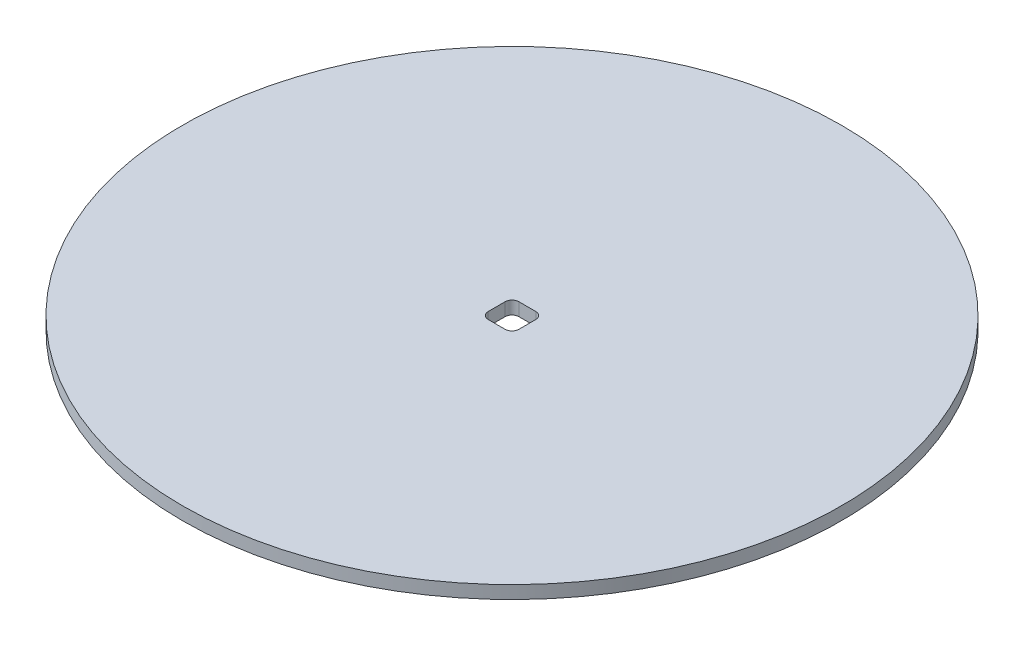
ISO-10303-21;
HEADER;
FILE_DESCRIPTION(('STEP AP214'),'2;1');
FILE_NAME('part.step','',(''),(''),'','','');
FILE_SCHEMA(('AUTOMOTIVE_DESIGN { 1 0 10303 214 1 1 1 1 }'));
ENDSEC;
DATA;
#1=APPLICATION_CONTEXT('core data for automotive mechanical design processes');
#2=APPLICATION_PROTOCOL_DEFINITION('international standard','automotive_design',2000,#1);
#3=PRODUCT_CONTEXT('',#1,'mechanical');
#4=PRODUCT('Part','Part','',(#3));
#5=PRODUCT_RELATED_PRODUCT_CATEGORY('part','',(#4));
#6=PRODUCT_DEFINITION_FORMATION('','',#4);
#7=PRODUCT_DEFINITION_CONTEXT('part definition',#1,'design');
#8=PRODUCT_DEFINITION('design','',#6,#7);
#9=PRODUCT_DEFINITION_SHAPE('','',#8);
#10=(LENGTH_UNIT() NAMED_UNIT(*) SI_UNIT(.MILLI.,.METRE.));
#11=(NAMED_UNIT(*) PLANE_ANGLE_UNIT() SI_UNIT($,.RADIAN.));
#12=(NAMED_UNIT(*) SI_UNIT($,.STERADIAN.) SOLID_ANGLE_UNIT());
#13=UNCERTAINTY_MEASURE_WITH_UNIT(LENGTH_MEASURE(1.E-05),#10,'distance_accuracy_value','');
#14=(GEOMETRIC_REPRESENTATION_CONTEXT(3) GLOBAL_UNCERTAINTY_ASSIGNED_CONTEXT((#13)) GLOBAL_UNIT_ASSIGNED_CONTEXT((#10,
#11,#12)) REPRESENTATION_CONTEXT('',''));
#15=CARTESIAN_POINT('',(0.,0.,0.));
#16=DIRECTION('',(0.,0.,1.));
#17=DIRECTION('',(1.,0.,0.));
#18=AXIS2_PLACEMENT_3D('',#15,#16,#17);
#19=CARTESIAN_POINT('',(0.,0.,0.));
#20=DIRECTION('',(0.,1.,0.));
#21=DIRECTION('',(0.,0.,1.));
#22=AXIS2_PLACEMENT_3D('',#19,#20,#21);
#23=PLANE('',#22);
#24=DIRECTION('',(-1.,0.,0.));
#25=VECTOR('',#24,1.);
#26=CARTESIAN_POINT('',(1.96849999999999,0.,3.556));
#27=LINE('',#26,#25);
#28=CARTESIAN_POINT('',(1.96849999999999,0.,3.556));
#29=VERTEX_POINT('',#28);
#30=CARTESIAN_POINT('',(-1.96849999999999,0.,3.556));
#31=VERTEX_POINT('',#30);
#32=EDGE_CURVE('E84',#29,#31,#27,.T.);
#33=ORIENTED_EDGE('',*,*,#32,.F.);
#34=CARTESIAN_POINT('',(1.9685,0.,1.9685));
#35=DIRECTION('',(0.,-1.,0.));
#36=DIRECTION('',(0.,0.,-1.));
#37=AXIS2_PLACEMENT_3D('',#34,#35,#36);
#38=CIRCLE('',#37,1.5875);
#39=CARTESIAN_POINT('',(3.556,0.,1.9685));
#40=VERTEX_POINT('',#39);
#41=EDGE_CURVE('E129',#29,#40,#38,.F.);
#42=ORIENTED_EDGE('',*,*,#41,.T.);
#43=DIRECTION('',(0.,0.,1.));
#44=VECTOR('',#43,1.);
#45=CARTESIAN_POINT('',(3.556,0.,-1.96849999999999));
#46=LINE('',#45,#44);
#47=CARTESIAN_POINT('',(3.556,0.,-1.96849999999999));
#48=VERTEX_POINT('',#47);
#49=EDGE_CURVE('E107',#48,#40,#46,.T.);
#50=ORIENTED_EDGE('',*,*,#49,.F.);
#51=CARTESIAN_POINT('',(1.9685,0.,-1.9685));
#52=DIRECTION('',(0.,-1.,0.));
#53=DIRECTION('',(0.,0.,-1.));
#54=AXIS2_PLACEMENT_3D('',#51,#52,#53);
#55=CIRCLE('',#54,1.5875);
#56=CARTESIAN_POINT('',(1.9685,0.,-3.556));
#57=VERTEX_POINT('',#56);
#58=EDGE_CURVE('E110',#48,#57,#55,.F.);
#59=ORIENTED_EDGE('',*,*,#58,.T.);
#60=DIRECTION('',(1.,0.,0.));
#61=VECTOR('',#60,1.);
#62=CARTESIAN_POINT('',(1.96849999999999,0.,-3.556));
#63=LINE('',#62,#61);
#64=CARTESIAN_POINT('',(-1.96849999999999,0.,-3.556));
#65=VERTEX_POINT('',#64);
#66=EDGE_CURVE('E111',#65,#57,#63,.T.);
#67=ORIENTED_EDGE('',*,*,#66,.F.);
#68=CARTESIAN_POINT('',(-1.9685,0.,-1.9685));
#69=DIRECTION('',(0.,-1.,0.));
#70=DIRECTION('',(0.,0.,-1.));
#71=AXIS2_PLACEMENT_3D('',#68,#69,#70);
#72=CIRCLE('',#71,1.5875);
#73=CARTESIAN_POINT('',(-3.556,0.,-1.96849999999999));
#74=VERTEX_POINT('',#73);
#75=EDGE_CURVE('E114',#65,#74,#72,.F.);
#76=ORIENTED_EDGE('',*,*,#75,.T.);
#77=DIRECTION('',(0.,0.,-1.));
#78=VECTOR('',#77,1.);
#79=CARTESIAN_POINT('',(-3.556,0.,-1.96849999999999));
#80=LINE('',#79,#78);
#81=CARTESIAN_POINT('',(-3.556,0.,1.9685));
#82=VERTEX_POINT('',#81);
#83=EDGE_CURVE('E79',#82,#74,#80,.T.);
#84=ORIENTED_EDGE('',*,*,#83,.F.);
#85=CARTESIAN_POINT('',(-1.9685,0.,1.9685));
#86=DIRECTION('',(0.,-1.,0.));
#87=DIRECTION('',(0.,0.,-1.));
#88=AXIS2_PLACEMENT_3D('',#85,#86,#87);
#89=CIRCLE('',#88,1.5875);
#90=EDGE_CURVE('E94',#82,#31,#89,.F.);
#91=ORIENTED_EDGE('',*,*,#90,.T.);
#92=EDGE_LOOP('',(#33,#42,#50,#59,#67,#76,#84,#91));
#93=FACE_BOUND('',#92,.T.);
#94=CARTESIAN_POINT('',(0.,0.,0.));
#95=DIRECTION('',(0.,-1.,0.));
#96=DIRECTION('',(0.,0.,-1.));
#97=AXIS2_PLACEMENT_3D('',#94,#95,#96);
#98=CIRCLE('',#97,76.2);
#99=CARTESIAN_POINT('',(0.,0.,-76.2));
#100=VERTEX_POINT('',#99);
#101=EDGE_CURVE('E20',#100,#100,#98,.F.);
#102=ORIENTED_EDGE('',*,*,#101,.F.);
#103=EDGE_LOOP('',(#102));
#104=FACE_BOUND('',#103,.T.);
#105=ADVANCED_FACE('F17',(#93,#104),#23,.F.);
#106=CARTESIAN_POINT('',(0.,3.,0.));
#107=DIRECTION('',(0.,-1.,0.));
#108=DIRECTION('',(0.,0.,-1.));
#109=AXIS2_PLACEMENT_3D('',#106,#107,#108);
#110=CYLINDRICAL_SURFACE('',#109,76.2);
#111=ORIENTED_EDGE('',*,*,#101,.T.);
#112=EDGE_LOOP('',(#111));
#113=FACE_BOUND('',#112,.T.);
#114=CARTESIAN_POINT('',(0.,3.,0.));
#115=DIRECTION('',(0.,-1.,0.));
#116=DIRECTION('',(0.,0.,-1.));
#117=AXIS2_PLACEMENT_3D('',#114,#115,#116);
#118=CIRCLE('',#117,76.2);
#119=CARTESIAN_POINT('',(0.,3.,-76.2));
#120=VERTEX_POINT('',#119);
#121=EDGE_CURVE('E126',#120,#120,#118,.F.);
#122=ORIENTED_EDGE('',*,*,#121,.F.);
#123=EDGE_LOOP('',(#122));
#124=FACE_BOUND('',#123,.T.);
#125=ADVANCED_FACE('F191',(#113,#124),#110,.T.);
#126=CARTESIAN_POINT('',(1.96849999999999,3.,3.556));
#127=DIRECTION('',(0.,0.,-1.));
#128=DIRECTION('',(-1.,0.,0.));
#129=AXIS2_PLACEMENT_3D('',#126,#127,#128);
#130=PLANE('',#129);
#131=DIRECTION('',(1.,0.,0.));
#132=VECTOR('',#131,1.);
#133=CARTESIAN_POINT('',(0.,3.,3.556));
#134=LINE('',#133,#132);
#135=CARTESIAN_POINT('',(1.96849999999999,3.,3.556));
#136=VERTEX_POINT('',#135);
#137=CARTESIAN_POINT('',(-1.96849999999999,3.,3.556));
#138=VERTEX_POINT('',#137);
#139=EDGE_CURVE('E125',#136,#138,#134,.F.);
#140=ORIENTED_EDGE('',*,*,#139,.F.);
#141=DIRECTION('',(0.,-1.,0.));
#142=VECTOR('',#141,1.);
#143=CARTESIAN_POINT('',(1.96849999999999,3.,3.556));
#144=LINE('',#143,#142);
#145=EDGE_CURVE('E90',#136,#29,#144,.T.);
#146=ORIENTED_EDGE('',*,*,#145,.T.);
#147=ORIENTED_EDGE('',*,*,#32,.T.);
#148=DIRECTION('',(0.,-1.,0.));
#149=VECTOR('',#148,1.);
#150=CARTESIAN_POINT('',(-1.96849999999999,3.,3.556));
#151=LINE('',#150,#149);
#152=EDGE_CURVE('E87',#31,#138,#151,.F.);
#153=ORIENTED_EDGE('',*,*,#152,.T.);
#154=EDGE_LOOP('',(#140,#146,#147,#153));
#155=FACE_BOUND('',#154,.T.);
#156=ADVANCED_FACE('F85',(#155),#130,.T.);
#157=CARTESIAN_POINT('',(-1.9685,3.,1.9685));
#158=DIRECTION('',(0.,-1.,0.));
#159=DIRECTION('',(0.,0.,-1.));
#160=AXIS2_PLACEMENT_3D('',#157,#158,#159);
#161=CYLINDRICAL_SURFACE('',#160,1.5875);
#162=DIRECTION('',(0.,1.,0.));
#163=VECTOR('',#162,1.);
#164=CARTESIAN_POINT('',(-3.556,3.,1.96849999999999));
#165=LINE('',#164,#163);
#166=CARTESIAN_POINT('',(-3.556,3.,1.9685));
#167=VERTEX_POINT('',#166);
#168=EDGE_CURVE('E104',#167,#82,#165,.F.);
#169=ORIENTED_EDGE('',*,*,#168,.F.);
#170=CARTESIAN_POINT('',(-1.9685,3.,1.9685));
#171=DIRECTION('',(0.,-1.,0.));
#172=DIRECTION('',(0.,0.,-1.));
#173=AXIS2_PLACEMENT_3D('',#170,#171,#172);
#174=CIRCLE('',#173,1.5875);
#175=EDGE_CURVE('E100',#138,#167,#174,.T.);
#176=ORIENTED_EDGE('',*,*,#175,.F.);
#177=ORIENTED_EDGE('',*,*,#152,.F.);
#178=ORIENTED_EDGE('',*,*,#90,.F.);
#179=EDGE_LOOP('',(#169,#176,#177,#178));
#180=FACE_BOUND('',#179,.T.);
#181=ADVANCED_FACE('F98',(#180),#161,.F.);
#182=CARTESIAN_POINT('',(-3.556,3.,-1.96849999999999));
#183=DIRECTION('',(1.,0.,0.));
#184=DIRECTION('',(0.,0.,-1.));
#185=AXIS2_PLACEMENT_3D('',#182,#183,#184);
#186=PLANE('',#185);
#187=DIRECTION('',(0.,0.,1.));
#188=VECTOR('',#187,1.);
#189=CARTESIAN_POINT('',(-3.556,3.,0.));
#190=LINE('',#189,#188);
#191=CARTESIAN_POINT('',(-3.556,3.,-1.96849999999999));
#192=VERTEX_POINT('',#191);
#193=EDGE_CURVE('E123',#167,#192,#190,.F.);
#194=ORIENTED_EDGE('',*,*,#193,.F.);
#195=ORIENTED_EDGE('',*,*,#168,.T.);
#196=ORIENTED_EDGE('',*,*,#83,.T.);
#197=DIRECTION('',(0.,-1.,0.));
#198=VECTOR('',#197,1.);
#199=CARTESIAN_POINT('',(-3.556,3.,-1.96849999999999));
#200=LINE('',#199,#198);
#201=EDGE_CURVE('E134',#74,#192,#200,.F.);
#202=ORIENTED_EDGE('',*,*,#201,.T.);
#203=EDGE_LOOP('',(#194,#195,#196,#202));
#204=FACE_BOUND('',#203,.T.);
#205=ADVANCED_FACE('F184',(#204),#186,.T.);
#206=CARTESIAN_POINT('',(-1.9685,3.,-1.9685));
#207=DIRECTION('',(0.,-1.,0.));
#208=DIRECTION('',(0.,0.,-1.));
#209=AXIS2_PLACEMENT_3D('',#206,#207,#208);
#210=CYLINDRICAL_SURFACE('',#209,1.5875);
#211=DIRECTION('',(0.,1.,0.));
#212=VECTOR('',#211,1.);
#213=CARTESIAN_POINT('',(-1.96849999999999,3.,-3.556));
#214=LINE('',#213,#212);
#215=CARTESIAN_POINT('',(-1.96849999999999,3.,-3.556));
#216=VERTEX_POINT('',#215);
#217=EDGE_CURVE('E113',#216,#65,#214,.F.);
#218=ORIENTED_EDGE('',*,*,#217,.F.);
#219=CARTESIAN_POINT('',(-1.9685,3.,-1.9685));
#220=DIRECTION('',(0.,-1.,0.));
#221=DIRECTION('',(0.,0.,-1.));
#222=AXIS2_PLACEMENT_3D('',#219,#220,#221);
#223=CIRCLE('',#222,1.5875);
#224=EDGE_CURVE('E120',#192,#216,#223,.T.);
#225=ORIENTED_EDGE('',*,*,#224,.F.);
#226=ORIENTED_EDGE('',*,*,#201,.F.);
#227=ORIENTED_EDGE('',*,*,#75,.F.);
#228=EDGE_LOOP('',(#218,#225,#226,#227));
#229=FACE_BOUND('',#228,.T.);
#230=ADVANCED_FACE('F180',(#229),#210,.F.);
#231=CARTESIAN_POINT('',(1.96849999999999,3.,-3.556));
#232=DIRECTION('',(0.,0.,1.));
#233=DIRECTION('',(1.,0.,0.));
#234=AXIS2_PLACEMENT_3D('',#231,#232,#233);
#235=PLANE('',#234);
#236=DIRECTION('',(1.,0.,0.));
#237=VECTOR('',#236,1.);
#238=CARTESIAN_POINT('',(0.,3.,-3.556));
#239=LINE('',#238,#237);
#240=CARTESIAN_POINT('',(1.9685,3.,-3.556));
#241=VERTEX_POINT('',#240);
#242=EDGE_CURVE('E119',#216,#241,#239,.T.);
#243=ORIENTED_EDGE('',*,*,#242,.F.);
#244=ORIENTED_EDGE('',*,*,#217,.T.);
#245=ORIENTED_EDGE('',*,*,#66,.T.);
#246=DIRECTION('',(0.,-1.,0.));
#247=VECTOR('',#246,1.);
#248=CARTESIAN_POINT('',(1.9685,3.,-3.556));
#249=LINE('',#248,#247);
#250=EDGE_CURVE('E133',#57,#241,#249,.F.);
#251=ORIENTED_EDGE('',*,*,#250,.T.);
#252=EDGE_LOOP('',(#243,#244,#245,#251));
#253=FACE_BOUND('',#252,.T.);
#254=ADVANCED_FACE('F177',(#253),#235,.T.);
#255=CARTESIAN_POINT('',(1.9685,3.,-1.9685));
#256=DIRECTION('',(0.,-1.,0.));
#257=DIRECTION('',(0.,0.,-1.));
#258=AXIS2_PLACEMENT_3D('',#255,#256,#257);
#259=CYLINDRICAL_SURFACE('',#258,1.5875);
#260=DIRECTION('',(0.,1.,0.));
#261=VECTOR('',#260,1.);
#262=CARTESIAN_POINT('',(3.556,3.,-1.96849999999999));
#263=LINE('',#262,#261);
#264=CARTESIAN_POINT('',(3.556,3.,-1.96849999999999));
#265=VERTEX_POINT('',#264);
#266=EDGE_CURVE('E109',#265,#48,#263,.F.);
#267=ORIENTED_EDGE('',*,*,#266,.F.);
#268=CARTESIAN_POINT('',(1.9685,3.,-1.9685));
#269=DIRECTION('',(0.,-1.,0.));
#270=DIRECTION('',(0.,0.,-1.));
#271=AXIS2_PLACEMENT_3D('',#268,#269,#270);
#272=CIRCLE('',#271,1.5875);
#273=EDGE_CURVE('E116',#241,#265,#272,.T.);
#274=ORIENTED_EDGE('',*,*,#273,.F.);
#275=ORIENTED_EDGE('',*,*,#250,.F.);
#276=ORIENTED_EDGE('',*,*,#58,.F.);
#277=EDGE_LOOP('',(#267,#274,#275,#276));
#278=FACE_BOUND('',#277,.T.);
#279=ADVANCED_FACE('F161',(#278),#259,.F.);
#280=CARTESIAN_POINT('',(3.556,3.,-1.96849999999999));
#281=DIRECTION('',(-1.,0.,0.));
#282=DIRECTION('',(0.,0.,1.));
#283=AXIS2_PLACEMENT_3D('',#280,#281,#282);
#284=PLANE('',#283);
#285=DIRECTION('',(0.,0.,1.));
#286=VECTOR('',#285,1.);
#287=CARTESIAN_POINT('',(3.556,3.,0.));
#288=LINE('',#287,#286);
#289=CARTESIAN_POINT('',(3.556,3.,1.9685));
#290=VERTEX_POINT('',#289);
#291=EDGE_CURVE('E26',#265,#290,#288,.T.);
#292=ORIENTED_EDGE('',*,*,#291,.F.);
#293=ORIENTED_EDGE('',*,*,#266,.T.);
#294=ORIENTED_EDGE('',*,*,#49,.T.);
#295=DIRECTION('',(0.,-1.,0.));
#296=VECTOR('',#295,1.);
#297=CARTESIAN_POINT('',(3.556,3.,1.96849999999999));
#298=LINE('',#297,#296);
#299=EDGE_CURVE('E35',#40,#290,#298,.F.);
#300=ORIENTED_EDGE('',*,*,#299,.T.);
#301=EDGE_LOOP('',(#292,#293,#294,#300));
#302=FACE_BOUND('',#301,.T.);
#303=ADVANCED_FACE('F158',(#302),#284,.T.);
#304=CARTESIAN_POINT('',(1.9685,3.,1.9685));
#305=DIRECTION('',(0.,-1.,0.));
#306=DIRECTION('',(0.,0.,-1.));
#307=AXIS2_PLACEMENT_3D('',#304,#305,#306);
#308=CYLINDRICAL_SURFACE('',#307,1.5875);
#309=ORIENTED_EDGE('',*,*,#145,.F.);
#310=CARTESIAN_POINT('',(1.9685,3.,1.9685));
#311=DIRECTION('',(0.,-1.,0.));
#312=DIRECTION('',(0.,0.,-1.));
#313=AXIS2_PLACEMENT_3D('',#310,#311,#312);
#314=CIRCLE('',#313,1.5875);
#315=EDGE_CURVE('E11',#290,#136,#314,.T.);
#316=ORIENTED_EDGE('',*,*,#315,.F.);
#317=ORIENTED_EDGE('',*,*,#299,.F.);
#318=ORIENTED_EDGE('',*,*,#41,.F.);
#319=EDGE_LOOP('',(#309,#316,#317,#318));
#320=FACE_BOUND('',#319,.T.);
#321=ADVANCED_FACE('F164',(#320),#308,.F.);
#322=CARTESIAN_POINT('',(0.,3.,0.));
#323=DIRECTION('',(0.,1.,0.));
#324=DIRECTION('',(0.,0.,1.));
#325=AXIS2_PLACEMENT_3D('',#322,#323,#324);
#326=PLANE('',#325);
#327=ORIENTED_EDGE('',*,*,#291,.T.);
#328=ORIENTED_EDGE('',*,*,#315,.T.);
#329=ORIENTED_EDGE('',*,*,#139,.T.);
#330=ORIENTED_EDGE('',*,*,#175,.T.);
#331=ORIENTED_EDGE('',*,*,#193,.T.);
#332=ORIENTED_EDGE('',*,*,#224,.T.);
#333=ORIENTED_EDGE('',*,*,#242,.T.);
#334=ORIENTED_EDGE('',*,*,#273,.T.);
#335=EDGE_LOOP('',(#327,#328,#329,#330,#331,#332,#333,#334));
#336=FACE_BOUND('',#335,.T.);
#337=ORIENTED_EDGE('',*,*,#121,.T.);
#338=EDGE_LOOP('',(#337));
#339=FACE_BOUND('',#338,.T.);
#340=ADVANCED_FACE('F155',(#336,#339),#326,.T.);
#341=CLOSED_SHELL('',(#105,#125,#156,#181,#205,#230,#254,#279,#303,#321,#340));
#342=MANIFOLD_SOLID_BREP('B1',#341);
#343=ADVANCED_BREP_SHAPE_REPRESENTATION('',(#18,#342),#14);
#344=SHAPE_DEFINITION_REPRESENTATION(#9,#343);
ENDSEC;
END-ISO-10303-21;
